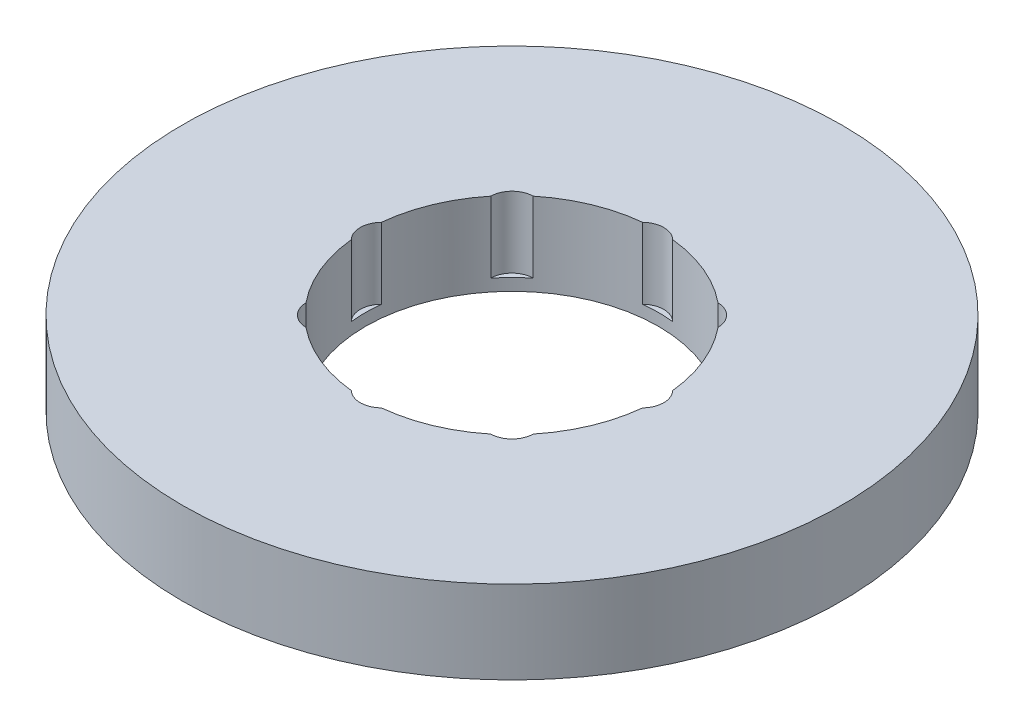
ISO-10303-21;
HEADER;
FILE_DESCRIPTION(('STEP AP214'),'2;1');
FILE_NAME('part.step','',(''),(''),'','','');
FILE_SCHEMA(('AUTOMOTIVE_DESIGN { 1 0 10303 214 1 1 1 1 }'));
ENDSEC;
DATA;
#1=APPLICATION_CONTEXT('core data for automotive mechanical design processes');
#2=APPLICATION_PROTOCOL_DEFINITION('international standard','automotive_design',2000,#1);
#3=PRODUCT_CONTEXT('',#1,'mechanical');
#4=PRODUCT('Part','Part','',(#3));
#5=PRODUCT_RELATED_PRODUCT_CATEGORY('part','',(#4));
#6=PRODUCT_DEFINITION_FORMATION('','',#4);
#7=PRODUCT_DEFINITION_CONTEXT('part definition',#1,'design');
#8=PRODUCT_DEFINITION('design','',#6,#7);
#9=PRODUCT_DEFINITION_SHAPE('','',#8);
#10=(LENGTH_UNIT() NAMED_UNIT(*) SI_UNIT(.MILLI.,.METRE.));
#11=(NAMED_UNIT(*) PLANE_ANGLE_UNIT() SI_UNIT($,.RADIAN.));
#12=(NAMED_UNIT(*) SI_UNIT($,.STERADIAN.) SOLID_ANGLE_UNIT());
#13=UNCERTAINTY_MEASURE_WITH_UNIT(LENGTH_MEASURE(1.E-05),#10,'distance_accuracy_value','');
#14=(GEOMETRIC_REPRESENTATION_CONTEXT(3) GLOBAL_UNCERTAINTY_ASSIGNED_CONTEXT((#13)) GLOBAL_UNIT_ASSIGNED_CONTEXT((#10,
#11,#12)) REPRESENTATION_CONTEXT('',''));
#15=CARTESIAN_POINT('',(0.,0.,0.));
#16=DIRECTION('',(0.,0.,1.));
#17=DIRECTION('',(1.,0.,0.));
#18=AXIS2_PLACEMENT_3D('',#15,#16,#17);
#19=CARTESIAN_POINT('',(0.,17.,0.));
#20=DIRECTION('',(0.,-1.,0.));
#21=DIRECTION('',(0.,0.,-1.));
#22=AXIS2_PLACEMENT_3D('',#19,#20,#21);
#23=CYLINDRICAL_SURFACE('',#22,67.5);
#24=CARTESIAN_POINT('',(0.,17.,0.));
#25=DIRECTION('',(0.,1.,0.));
#26=DIRECTION('',(0.,0.,1.));
#27=AXIS2_PLACEMENT_3D('',#24,#25,#26);
#28=CIRCLE('',#27,67.5);
#29=CARTESIAN_POINT('',(0.,17.,67.5));
#30=VERTEX_POINT('',#29);
#31=EDGE_CURVE('E183',#30,#30,#28,.T.);
#32=ORIENTED_EDGE('',*,*,#31,.F.);
#33=EDGE_LOOP('',(#32));
#34=FACE_BOUND('',#33,.T.);
#35=CARTESIAN_POINT('',(0.,0.,0.));
#36=DIRECTION('',(0.,1.,0.));
#37=DIRECTION('',(0.,0.,1.));
#38=AXIS2_PLACEMENT_3D('',#35,#36,#37);
#39=CIRCLE('',#38,67.5);
#40=CARTESIAN_POINT('',(0.,0.,67.5));
#41=VERTEX_POINT('',#40);
#42=EDGE_CURVE('E182',#41,#41,#39,.T.);
#43=ORIENTED_EDGE('',*,*,#42,.T.);
#44=EDGE_LOOP('',(#43));
#45=FACE_BOUND('',#44,.T.);
#46=ADVANCED_FACE('F39',(#34,#45),#23,.T.);
#47=CARTESIAN_POINT('',(0.,17.,0.));
#48=DIRECTION('',(0.,1.,0.));
#49=DIRECTION('',(0.,0.,1.));
#50=AXIS2_PLACEMENT_3D('',#47,#48,#49);
#51=PLANE('',#50);
#52=CARTESIAN_POINT('',(0.,17.,26.6588130686792));
#53=DIRECTION('',(0.,1.,0.));
#54=DIRECTION('',(1.,0.,0.));
#55=AXIS2_PLACEMENT_3D('',#52,#53,#54);
#56=CIRCLE('',#55,4.42688473431246);
#57=CARTESIAN_POINT('',(-3.07664994384005,17.,29.8418200705498));
#58=VERTEX_POINT('',#57);
#59=CARTESIAN_POINT('',(3.07664994384026,17.,29.8418200705498));
#60=VERTEX_POINT('',#59);
#61=EDGE_CURVE('E256',#58,#60,#56,.T.);
#62=ORIENTED_EDGE('',*,*,#61,.F.);
#63=CARTESIAN_POINT('',(0.,17.,0.));
#64=DIRECTION('',(0.,1.,0.));
#65=DIRECTION('',(0.,0.,1.));
#66=AXIS2_PLACEMENT_3D('',#63,#64,#65);
#67=CIRCLE('',#66,30.);
#68=CARTESIAN_POINT('',(-18.9258332962079,17.,23.2768733734612));
#69=VERTEX_POINT('',#68);
#70=EDGE_CURVE('E175',#69,#58,#67,.T.);
#71=ORIENTED_EDGE('',*,*,#70,.F.);
#72=CARTESIAN_POINT('',(-18.8506274992476,17.,18.8506274992477));
#73=DIRECTION('',(0.,1.,0.));
#74=DIRECTION('',(0.707106781186549,0.,0.707106781186546));
#75=AXIS2_PLACEMENT_3D('',#72,#73,#74);
#76=CIRCLE('',#75,4.42688473431246);
#77=CARTESIAN_POINT('',(-23.2768733734611,17.,18.925833296208));
#78=VERTEX_POINT('',#77);
#79=EDGE_CURVE('E152',#78,#69,#76,.T.);
#80=ORIENTED_EDGE('',*,*,#79,.F.);
#81=CARTESIAN_POINT('',(-29.8418200705498,17.,3.07664994384015));
#82=VERTEX_POINT('',#81);
#83=EDGE_CURVE('E168',#82,#78,#67,.T.);
#84=ORIENTED_EDGE('',*,*,#83,.F.);
#85=CARTESIAN_POINT('',(-26.6588130686792,17.,0.));
#86=DIRECTION('',(0.,1.,0.));
#87=DIRECTION('',(0.,0.,1.));
#88=AXIS2_PLACEMENT_3D('',#85,#86,#87);
#89=CIRCLE('',#88,4.42688473431246);
#90=CARTESIAN_POINT('',(-29.8418200705498,17.,-3.07664994384015));
#91=VERTEX_POINT('',#90);
#92=EDGE_CURVE('E205',#91,#82,#89,.T.);
#93=ORIENTED_EDGE('',*,*,#92,.F.);
#94=CARTESIAN_POINT('',(-23.2768733734614,17.,-18.9258332962077));
#95=VERTEX_POINT('',#94);
#96=EDGE_CURVE('E181',#95,#91,#67,.T.);
#97=ORIENTED_EDGE('',*,*,#96,.F.);
#98=CARTESIAN_POINT('',(-18.8506274992479,17.,-18.8506274992474));
#99=DIRECTION('',(0.,1.,0.));
#100=DIRECTION('',(-0.707106781186539,0.,0.707106781186556));
#101=AXIS2_PLACEMENT_3D('',#98,#99,#100);
#102=CIRCLE('',#101,4.42688473431246);
#103=CARTESIAN_POINT('',(-18.9258332962083,17.,-23.2768733734609));
#104=VERTEX_POINT('',#103);
#105=EDGE_CURVE('E453',#104,#95,#102,.T.);
#106=ORIENTED_EDGE('',*,*,#105,.F.);
#107=CARTESIAN_POINT('',(-3.07664994384047,17.,-29.8418200705498));
#108=VERTEX_POINT('',#107);
#109=EDGE_CURVE('E189',#108,#104,#67,.T.);
#110=ORIENTED_EDGE('',*,*,#109,.F.);
#111=CARTESIAN_POINT('',(-2.79236245035003E-13,17.,-26.6588130686792));
#112=DIRECTION('',(0.,1.,0.));
#113=DIRECTION('',(-1.,0.,0.));
#114=AXIS2_PLACEMENT_3D('',#111,#112,#113);
#115=CIRCLE('',#114,4.42688473431246);
#116=CARTESIAN_POINT('',(3.07664994383984,17.,-29.8418200705498));
#117=VERTEX_POINT('',#116);
#118=EDGE_CURVE('E462',#117,#108,#115,.T.);
#119=ORIENTED_EDGE('',*,*,#118,.F.);
#120=CARTESIAN_POINT('',(18.9258332962078,17.,-23.2768733734613));
#121=VERTEX_POINT('',#120);
#122=EDGE_CURVE('E197',#121,#117,#67,.T.);
#123=ORIENTED_EDGE('',*,*,#122,.F.);
#124=CARTESIAN_POINT('',(18.8506274992475,17.,-18.8506274992478));
#125=DIRECTION('',(0.,1.,0.));
#126=DIRECTION('',(-0.707106781186554,0.,-0.707106781186541));
#127=AXIS2_PLACEMENT_3D('',#124,#125,#126);
#128=CIRCLE('',#127,4.42688473431246);
#129=CARTESIAN_POINT('',(23.276873373461,17.,-18.9258332962082));
#130=VERTEX_POINT('',#129);
#131=EDGE_CURVE('E470',#130,#121,#128,.T.);
#132=ORIENTED_EDGE('',*,*,#131,.F.);
#133=CARTESIAN_POINT('',(29.8418200705498,17.,-3.07664994384015));
#134=VERTEX_POINT('',#133);
#135=EDGE_CURVE('E489',#134,#130,#67,.T.);
#136=ORIENTED_EDGE('',*,*,#135,.F.);
#137=CARTESIAN_POINT('',(26.6588130686792,17.,0.));
#138=DIRECTION('',(0.,1.,0.));
#139=DIRECTION('',(0.,0.,-1.));
#140=AXIS2_PLACEMENT_3D('',#137,#138,#139);
#141=CIRCLE('',#140,4.42688473431246);
#142=CARTESIAN_POINT('',(29.8418200705498,17.,3.07664994384015));
#143=VERTEX_POINT('',#142);
#144=EDGE_CURVE('E476',#143,#134,#141,.T.);
#145=ORIENTED_EDGE('',*,*,#144,.F.);
#146=CARTESIAN_POINT('',(23.2768733734613,17.,18.9258332962079));
#147=VERTEX_POINT('',#146);
#148=EDGE_CURVE('E491',#147,#143,#67,.T.);
#149=ORIENTED_EDGE('',*,*,#148,.F.);
#150=CARTESIAN_POINT('',(18.8506274992477,17.,18.8506274992475));
#151=DIRECTION('',(0.,1.,0.));
#152=DIRECTION('',(0.707106781186544,0.,-0.707106781186551));
#153=AXIS2_PLACEMENT_3D('',#150,#151,#152);
#154=CIRCLE('',#153,4.42688473431246);
#155=CARTESIAN_POINT('',(18.9258332962081,17.,23.2768733734611));
#156=VERTEX_POINT('',#155);
#157=EDGE_CURVE('E475',#156,#147,#154,.T.);
#158=ORIENTED_EDGE('',*,*,#157,.F.);
#159=EDGE_CURVE('E190',#60,#156,#67,.T.);
#160=ORIENTED_EDGE('',*,*,#159,.F.);
#161=EDGE_LOOP('',(#62,#71,#80,#84,#93,#97,#106,#110,#119,#123,#132,#136,#145,#149,#158,#160));
#162=FACE_BOUND('',#161,.T.);
#163=ORIENTED_EDGE('',*,*,#31,.T.);
#164=EDGE_LOOP('',(#163));
#165=FACE_BOUND('',#164,.T.);
#166=ADVANCED_FACE('F170',(#162,#165),#51,.T.);
#167=CARTESIAN_POINT('',(0.,0.,0.));
#168=DIRECTION('',(0.,1.,0.));
#169=DIRECTION('',(0.,0.,1.));
#170=AXIS2_PLACEMENT_3D('',#167,#168,#169);
#171=PLANE('',#170);
#172=CARTESIAN_POINT('',(0.,0.,0.));
#173=DIRECTION('',(0.,1.,0.));
#174=DIRECTION('',(0.,0.,1.));
#175=AXIS2_PLACEMENT_3D('',#172,#173,#174);
#176=CIRCLE('',#175,30.);
#177=CARTESIAN_POINT('',(0.,0.,30.));
#178=VERTEX_POINT('',#177);
#179=EDGE_CURVE('E191',#178,#178,#176,.T.);
#180=ORIENTED_EDGE('',*,*,#179,.T.);
#181=EDGE_LOOP('',(#180));
#182=FACE_BOUND('',#181,.T.);
#183=ORIENTED_EDGE('',*,*,#42,.F.);
#184=EDGE_LOOP('',(#183));
#185=FACE_BOUND('',#184,.T.);
#186=ADVANCED_FACE('F277',(#182,#185),#171,.F.);
#187=CARTESIAN_POINT('',(0.,17.,0.));
#188=DIRECTION('',(0.,-1.,0.));
#189=DIRECTION('',(0.,0.,-1.));
#190=AXIS2_PLACEMENT_3D('',#187,#188,#189);
#191=CYLINDRICAL_SURFACE('',#190,30.);
#192=DIRECTION('',(0.,1.,0.));
#193=VECTOR('',#192,1.);
#194=CARTESIAN_POINT('',(-3.07664994384004,9.7318943138592,29.8418200705498));
#195=LINE('',#194,#193);
#196=CARTESIAN_POINT('',(-3.07664994384005,2.46378862771841,29.8418200705498));
#197=VERTEX_POINT('',#196);
#198=EDGE_CURVE('E11',#197,#58,#195,.T.);
#199=ORIENTED_EDGE('',*,*,#198,.F.);
#200=CARTESIAN_POINT('',(0.,2.46378862771841,0.));
#201=DIRECTION('',(0.,1.,0.));
#202=DIRECTION('',(0.,0.,1.));
#203=AXIS2_PLACEMENT_3D('',#200,#201,#202);
#204=CIRCLE('',#203,30.);
#205=CARTESIAN_POINT('',(3.07664994384026,2.46378862771841,29.8418200705498));
#206=VERTEX_POINT('',#205);
#207=EDGE_CURVE('E251',#197,#206,#204,.T.);
#208=ORIENTED_EDGE('',*,*,#207,.T.);
#209=DIRECTION('',(0.,1.,0.));
#210=VECTOR('',#209,1.);
#211=CARTESIAN_POINT('',(3.07664994384025,9.7318943138592,29.8418200705498));
#212=LINE('',#211,#210);
#213=EDGE_CURVE('E46',#60,#206,#212,.F.);
#214=ORIENTED_EDGE('',*,*,#213,.F.);
#215=ORIENTED_EDGE('',*,*,#159,.T.);
#216=DIRECTION('',(0.,1.,0.));
#217=VECTOR('',#216,1.);
#218=CARTESIAN_POINT('',(18.9258332962081,9.7318943138592,23.2768733734611));
#219=LINE('',#218,#217);
#220=CARTESIAN_POINT('',(18.9258332962081,2.46378862771841,23.2768733734611));
#221=VERTEX_POINT('',#220);
#222=EDGE_CURVE('E253',#221,#156,#219,.T.);
#223=ORIENTED_EDGE('',*,*,#222,.F.);
#224=CARTESIAN_POINT('',(0.,2.46378862771841,0.));
#225=DIRECTION('',(0.,1.,0.));
#226=DIRECTION('',(0.,0.,1.));
#227=AXIS2_PLACEMENT_3D('',#224,#225,#226);
#228=CIRCLE('',#227,30.);
#229=CARTESIAN_POINT('',(23.2768733734613,2.46378862771841,18.9258332962079));
#230=VERTEX_POINT('',#229);
#231=EDGE_CURVE('E246',#221,#230,#228,.T.);
#232=ORIENTED_EDGE('',*,*,#231,.T.);
#233=DIRECTION('',(0.,1.,0.));
#234=VECTOR('',#233,1.);
#235=CARTESIAN_POINT('',(23.2768733734613,9.7318943138592,18.9258332962079));
#236=LINE('',#235,#234);
#237=EDGE_CURVE('E248',#147,#230,#236,.F.);
#238=ORIENTED_EDGE('',*,*,#237,.F.);
#239=ORIENTED_EDGE('',*,*,#148,.T.);
#240=DIRECTION('',(0.,1.,0.));
#241=VECTOR('',#240,1.);
#242=CARTESIAN_POINT('',(29.8418200705498,9.7318943138592,3.07664994384015));
#243=LINE('',#242,#241);
#244=CARTESIAN_POINT('',(29.8418200705498,2.46378862771841,3.07664994384015));
#245=VERTEX_POINT('',#244);
#246=EDGE_CURVE('E243',#245,#143,#243,.T.);
#247=ORIENTED_EDGE('',*,*,#246,.F.);
#248=CARTESIAN_POINT('',(0.,2.46378862771841,0.));
#249=DIRECTION('',(0.,1.,0.));
#250=DIRECTION('',(0.,0.,1.));
#251=AXIS2_PLACEMENT_3D('',#248,#249,#250);
#252=CIRCLE('',#251,30.);
#253=CARTESIAN_POINT('',(29.8418200705498,2.46378862771841,-3.07664994384015));
#254=VERTEX_POINT('',#253);
#255=EDGE_CURVE('E236',#245,#254,#252,.T.);
#256=ORIENTED_EDGE('',*,*,#255,.T.);
#257=DIRECTION('',(0.,1.,0.));
#258=VECTOR('',#257,1.);
#259=CARTESIAN_POINT('',(29.8418200705498,9.7318943138592,-3.07664994384015));
#260=LINE('',#259,#258);
#261=EDGE_CURVE('E241',#134,#254,#260,.F.);
#262=ORIENTED_EDGE('',*,*,#261,.F.);
#263=ORIENTED_EDGE('',*,*,#135,.T.);
#264=DIRECTION('',(0.,1.,0.));
#265=VECTOR('',#264,1.);
#266=CARTESIAN_POINT('',(23.276873373461,9.7318943138592,-18.9258332962082));
#267=LINE('',#266,#265);
#268=CARTESIAN_POINT('',(23.276873373461,2.46378862771841,-18.9258332962082));
#269=VERTEX_POINT('',#268);
#270=EDGE_CURVE('E237',#269,#130,#267,.T.);
#271=ORIENTED_EDGE('',*,*,#270,.F.);
#272=CARTESIAN_POINT('',(0.,2.46378862771841,0.));
#273=DIRECTION('',(0.,1.,0.));
#274=DIRECTION('',(0.,0.,1.));
#275=AXIS2_PLACEMENT_3D('',#272,#273,#274);
#276=CIRCLE('',#275,30.);
#277=CARTESIAN_POINT('',(18.9258332962078,2.46378862771841,-23.2768733734613));
#278=VERTEX_POINT('',#277);
#279=EDGE_CURVE('E229',#269,#278,#276,.T.);
#280=ORIENTED_EDGE('',*,*,#279,.T.);
#281=DIRECTION('',(0.,1.,0.));
#282=VECTOR('',#281,1.);
#283=CARTESIAN_POINT('',(18.9258332962078,9.7318943138592,-23.2768733734613));
#284=LINE('',#283,#282);
#285=EDGE_CURVE('E232',#121,#278,#284,.F.);
#286=ORIENTED_EDGE('',*,*,#285,.F.);
#287=ORIENTED_EDGE('',*,*,#122,.T.);
#288=DIRECTION('',(0.,1.,0.));
#289=VECTOR('',#288,1.);
#290=CARTESIAN_POINT('',(3.07664994383983,9.7318943138592,-29.8418200705498));
#291=LINE('',#290,#289);
#292=CARTESIAN_POINT('',(3.07664994383984,2.46378862771841,-29.8418200705498));
#293=VERTEX_POINT('',#292);
#294=EDGE_CURVE('E227',#293,#117,#291,.T.);
#295=ORIENTED_EDGE('',*,*,#294,.F.);
#296=CARTESIAN_POINT('',(0.,2.46378862771841,0.));
#297=DIRECTION('',(0.,1.,0.));
#298=DIRECTION('',(0.,0.,1.));
#299=AXIS2_PLACEMENT_3D('',#296,#297,#298);
#300=CIRCLE('',#299,30.);
#301=CARTESIAN_POINT('',(-3.07664994384047,2.46378862771841,-29.8418200705498));
#302=VERTEX_POINT('',#301);
#303=EDGE_CURVE('E225',#293,#302,#300,.T.);
#304=ORIENTED_EDGE('',*,*,#303,.T.);
#305=DIRECTION('',(0.,1.,0.));
#306=VECTOR('',#305,1.);
#307=CARTESIAN_POINT('',(-3.07664994384046,9.7318943138592,-29.8418200705498));
#308=LINE('',#307,#306);
#309=EDGE_CURVE('E223',#108,#302,#308,.F.);
#310=ORIENTED_EDGE('',*,*,#309,.F.);
#311=ORIENTED_EDGE('',*,*,#109,.T.);
#312=DIRECTION('',(0.,1.,0.));
#313=VECTOR('',#312,1.);
#314=CARTESIAN_POINT('',(-18.9258332962083,9.7318943138592,-23.2768733734609));
#315=LINE('',#314,#313);
#316=CARTESIAN_POINT('',(-18.9258332962083,2.46378862771841,-23.2768733734609));
#317=VERTEX_POINT('',#316);
#318=EDGE_CURVE('E219',#317,#104,#315,.T.);
#319=ORIENTED_EDGE('',*,*,#318,.F.);
#320=CARTESIAN_POINT('',(0.,2.46378862771841,0.));
#321=DIRECTION('',(0.,1.,0.));
#322=DIRECTION('',(0.,0.,1.));
#323=AXIS2_PLACEMENT_3D('',#320,#321,#322);
#324=CIRCLE('',#323,30.);
#325=CARTESIAN_POINT('',(-23.2768733734614,2.46378862771841,-18.9258332962077));
#326=VERTEX_POINT('',#325);
#327=EDGE_CURVE('E159',#317,#326,#324,.T.);
#328=ORIENTED_EDGE('',*,*,#327,.T.);
#329=DIRECTION('',(0.,1.,0.));
#330=VECTOR('',#329,1.);
#331=CARTESIAN_POINT('',(-23.2768733734614,9.7318943138592,-18.9258332962077));
#332=LINE('',#331,#330);
#333=EDGE_CURVE('E220',#95,#326,#332,.F.);
#334=ORIENTED_EDGE('',*,*,#333,.F.);
#335=ORIENTED_EDGE('',*,*,#96,.T.);
#336=DIRECTION('',(0.,1.,0.));
#337=VECTOR('',#336,1.);
#338=CARTESIAN_POINT('',(-29.8418200705498,9.7318943138592,-3.07664994384015));
#339=LINE('',#338,#337);
#340=CARTESIAN_POINT('',(-29.8418200705498,2.46378862771841,-3.07664994384015));
#341=VERTEX_POINT('',#340);
#342=EDGE_CURVE('E209',#341,#91,#339,.T.);
#343=ORIENTED_EDGE('',*,*,#342,.F.);
#344=CARTESIAN_POINT('',(0.,2.46378862771841,0.));
#345=DIRECTION('',(0.,1.,0.));
#346=DIRECTION('',(0.,0.,1.));
#347=AXIS2_PLACEMENT_3D('',#344,#345,#346);
#348=CIRCLE('',#347,30.);
#349=CARTESIAN_POINT('',(-29.8418200705498,2.46378862771841,3.07664994384015));
#350=VERTEX_POINT('',#349);
#351=EDGE_CURVE('E206',#341,#350,#348,.T.);
#352=ORIENTED_EDGE('',*,*,#351,.T.);
#353=DIRECTION('',(0.,1.,0.));
#354=VECTOR('',#353,1.);
#355=CARTESIAN_POINT('',(-29.8418200705498,9.7318943138592,3.07664994384015));
#356=LINE('',#355,#354);
#357=EDGE_CURVE('E179',#82,#350,#356,.F.);
#358=ORIENTED_EDGE('',*,*,#357,.F.);
#359=ORIENTED_EDGE('',*,*,#83,.T.);
#360=DIRECTION('',(0.,1.,0.));
#361=VECTOR('',#360,1.);
#362=CARTESIAN_POINT('',(-23.2768733734611,9.7318943138592,18.925833296208));
#363=LINE('',#362,#361);
#364=CARTESIAN_POINT('',(-23.2768733734611,2.46378862771841,18.925833296208));
#365=VERTEX_POINT('',#364);
#366=EDGE_CURVE('E147',#365,#78,#363,.T.);
#367=ORIENTED_EDGE('',*,*,#366,.F.);
#368=CARTESIAN_POINT('',(0.,2.46378862771841,0.));
#369=DIRECTION('',(0.,1.,0.));
#370=DIRECTION('',(0.,0.,1.));
#371=AXIS2_PLACEMENT_3D('',#368,#369,#370);
#372=CIRCLE('',#371,30.);
#373=CARTESIAN_POINT('',(-18.9258332962079,2.46378862771841,23.2768733734612));
#374=VERTEX_POINT('',#373);
#375=EDGE_CURVE('E215',#365,#374,#372,.T.);
#376=ORIENTED_EDGE('',*,*,#375,.T.);
#377=DIRECTION('',(0.,1.,0.));
#378=VECTOR('',#377,1.);
#379=CARTESIAN_POINT('',(-18.9258332962079,9.7318943138592,23.2768733734612));
#380=LINE('',#379,#378);
#381=EDGE_CURVE('E161',#69,#374,#380,.F.);
#382=ORIENTED_EDGE('',*,*,#381,.F.);
#383=ORIENTED_EDGE('',*,*,#70,.T.);
#384=EDGE_LOOP('',(#199,#208,#214,#215,#223,#232,#238,#239,#247,#256,#262,#263,#271,#280,#286,
#287,#295,#304,#310,#311,#319,#328,#334,#335,#343,#352,#358,#359,#367,#376,#382,#383));
#385=FACE_BOUND('',#384,.T.);
#386=ORIENTED_EDGE('',*,*,#179,.F.);
#387=EDGE_LOOP('',(#386));
#388=FACE_BOUND('',#387,.T.);
#389=ADVANCED_FACE('F176',(#385,#388),#191,.F.);
#390=CARTESIAN_POINT('',(-26.6588130686792,2.46378862771841,0.));
#391=DIRECTION('',(0.,1.,0.));
#392=DIRECTION('',(0.,0.,1.));
#393=AXIS2_PLACEMENT_3D('',#390,#391,#392);
#394=CYLINDRICAL_SURFACE('',#393,4.42688473431246);
#395=ORIENTED_EDGE('',*,*,#342,.T.);
#396=ORIENTED_EDGE('',*,*,#92,.T.);
#397=ORIENTED_EDGE('',*,*,#357,.T.);
#398=CARTESIAN_POINT('',(-26.6588130686792,2.46378862771841,0.));
#399=DIRECTION('',(0.,1.,0.));
#400=DIRECTION('',(0.,0.,1.));
#401=AXIS2_PLACEMENT_3D('',#398,#399,#400);
#402=CIRCLE('',#401,4.42688473431246);
#403=EDGE_CURVE('E200',#341,#350,#402,.T.);
#404=ORIENTED_EDGE('',*,*,#403,.F.);
#405=EDGE_LOOP('',(#395,#396,#397,#404));
#406=FACE_BOUND('',#405,.T.);
#407=ADVANCED_FACE('F286',(#406),#394,.F.);
#408=CARTESIAN_POINT('',(-26.6588130686792,2.46378862771841,0.));
#409=DIRECTION('',(0.,1.,0.));
#410=DIRECTION('',(0.,0.,1.));
#411=AXIS2_PLACEMENT_3D('',#408,#409,#410);
#412=PLANE('',#411);
#413=ORIENTED_EDGE('',*,*,#403,.T.);
#414=ORIENTED_EDGE('',*,*,#351,.F.);
#415=EDGE_LOOP('',(#413,#414));
#416=FACE_BOUND('',#415,.T.);
#417=ADVANCED_FACE('F289',(#416),#412,.T.);
#418=CARTESIAN_POINT('',(-18.8506274992476,2.46378862771841,18.8506274992477));
#419=DIRECTION('',(0.,1.,0.));
#420=DIRECTION('',(0.,0.,1.));
#421=AXIS2_PLACEMENT_3D('',#418,#419,#420);
#422=CYLINDRICAL_SURFACE('',#421,4.42688473431246);
#423=ORIENTED_EDGE('',*,*,#366,.T.);
#424=ORIENTED_EDGE('',*,*,#79,.T.);
#425=ORIENTED_EDGE('',*,*,#381,.T.);
#426=CARTESIAN_POINT('',(-18.8506274992476,2.46378862771841,18.8506274992477));
#427=DIRECTION('',(0.,1.,0.));
#428=DIRECTION('',(0.707106781186549,0.,0.707106781186546));
#429=AXIS2_PLACEMENT_3D('',#426,#427,#428);
#430=CIRCLE('',#429,4.42688473431246);
#431=EDGE_CURVE('E156',#365,#374,#430,.T.);
#432=ORIENTED_EDGE('',*,*,#431,.F.);
#433=EDGE_LOOP('',(#423,#424,#425,#432));
#434=FACE_BOUND('',#433,.T.);
#435=ADVANCED_FACE('F155',(#434),#422,.F.);
#436=CARTESIAN_POINT('',(-18.8506274992476,2.46378862771841,18.8506274992477));
#437=DIRECTION('',(0.,1.,0.));
#438=DIRECTION('',(0.707106781186549,0.,0.707106781186546));
#439=AXIS2_PLACEMENT_3D('',#436,#437,#438);
#440=PLANE('',#439);
#441=ORIENTED_EDGE('',*,*,#431,.T.);
#442=ORIENTED_EDGE('',*,*,#375,.F.);
#443=EDGE_LOOP('',(#441,#442));
#444=FACE_BOUND('',#443,.T.);
#445=ADVANCED_FACE('F300',(#444),#440,.T.);
#446=CARTESIAN_POINT('',(-18.8506274992479,2.46378862771841,-18.8506274992474));
#447=DIRECTION('',(0.,1.,0.));
#448=DIRECTION('',(0.,0.,1.));
#449=AXIS2_PLACEMENT_3D('',#446,#447,#448);
#450=CYLINDRICAL_SURFACE('',#449,4.42688473431246);
#451=ORIENTED_EDGE('',*,*,#318,.T.);
#452=ORIENTED_EDGE('',*,*,#105,.T.);
#453=ORIENTED_EDGE('',*,*,#333,.T.);
#454=CARTESIAN_POINT('',(-18.8506274992479,2.46378862771841,-18.8506274992474));
#455=DIRECTION('',(0.,1.,0.));
#456=DIRECTION('',(-0.707106781186539,0.,0.707106781186556));
#457=AXIS2_PLACEMENT_3D('',#454,#455,#456);
#458=CIRCLE('',#457,4.42688473431246);
#459=EDGE_CURVE('E454',#317,#326,#458,.T.);
#460=ORIENTED_EDGE('',*,*,#459,.F.);
#461=EDGE_LOOP('',(#451,#452,#453,#460));
#462=FACE_BOUND('',#461,.T.);
#463=ADVANCED_FACE('F299',(#462),#450,.F.);
#464=CARTESIAN_POINT('',(-18.8506274992479,2.46378862771841,-18.8506274992474));
#465=DIRECTION('',(0.,1.,0.));
#466=DIRECTION('',(-0.707106781186539,0.,0.707106781186556));
#467=AXIS2_PLACEMENT_3D('',#464,#465,#466);
#468=PLANE('',#467);
#469=ORIENTED_EDGE('',*,*,#459,.T.);
#470=ORIENTED_EDGE('',*,*,#327,.F.);
#471=EDGE_LOOP('',(#469,#470));
#472=FACE_BOUND('',#471,.T.);
#473=ADVANCED_FACE('F379',(#472),#468,.T.);
#474=CARTESIAN_POINT('',(-2.79236245035003E-13,2.46378862771841,-26.6588130686792));
#475=DIRECTION('',(0.,1.,0.));
#476=DIRECTION('',(0.,0.,1.));
#477=AXIS2_PLACEMENT_3D('',#474,#475,#476);
#478=CYLINDRICAL_SURFACE('',#477,4.42688473431246);
#479=ORIENTED_EDGE('',*,*,#294,.T.);
#480=ORIENTED_EDGE('',*,*,#118,.T.);
#481=ORIENTED_EDGE('',*,*,#309,.T.);
#482=CARTESIAN_POINT('',(-2.79236245035003E-13,2.46378862771841,-26.6588130686792));
#483=DIRECTION('',(0.,1.,0.));
#484=DIRECTION('',(-1.,0.,0.));
#485=AXIS2_PLACEMENT_3D('',#482,#483,#484);
#486=CIRCLE('',#485,4.42688473431246);
#487=EDGE_CURVE('E465',#293,#302,#486,.T.);
#488=ORIENTED_EDGE('',*,*,#487,.F.);
#489=EDGE_LOOP('',(#479,#480,#481,#488));
#490=FACE_BOUND('',#489,.T.);
#491=ADVANCED_FACE('F371',(#490),#478,.F.);
#492=CARTESIAN_POINT('',(-2.79236245035003E-13,2.46378862771841,-26.6588130686792));
#493=DIRECTION('',(0.,1.,0.));
#494=DIRECTION('',(-1.,0.,0.));
#495=AXIS2_PLACEMENT_3D('',#492,#493,#494);
#496=PLANE('',#495);
#497=ORIENTED_EDGE('',*,*,#487,.T.);
#498=ORIENTED_EDGE('',*,*,#303,.F.);
#499=EDGE_LOOP('',(#497,#498));
#500=FACE_BOUND('',#499,.T.);
#501=ADVANCED_FACE('F308',(#500),#496,.T.);
#502=CARTESIAN_POINT('',(18.8506274992475,2.46378862771841,-18.8506274992478));
#503=DIRECTION('',(0.,1.,0.));
#504=DIRECTION('',(0.,0.,1.));
#505=AXIS2_PLACEMENT_3D('',#502,#503,#504);
#506=CYLINDRICAL_SURFACE('',#505,4.42688473431246);
#507=ORIENTED_EDGE('',*,*,#270,.T.);
#508=ORIENTED_EDGE('',*,*,#131,.T.);
#509=ORIENTED_EDGE('',*,*,#285,.T.);
#510=CARTESIAN_POINT('',(18.8506274992475,2.46378862771841,-18.8506274992478));
#511=DIRECTION('',(0.,1.,0.));
#512=DIRECTION('',(-0.707106781186554,0.,-0.707106781186541));
#513=AXIS2_PLACEMENT_3D('',#510,#511,#512);
#514=CIRCLE('',#513,4.42688473431246);
#515=EDGE_CURVE('E477',#269,#278,#514,.T.);
#516=ORIENTED_EDGE('',*,*,#515,.F.);
#517=EDGE_LOOP('',(#507,#508,#509,#516));
#518=FACE_BOUND('',#517,.T.);
#519=ADVANCED_FACE('F305',(#518),#506,.F.);
#520=CARTESIAN_POINT('',(18.8506274992475,2.46378862771841,-18.8506274992478));
#521=DIRECTION('',(0.,1.,0.));
#522=DIRECTION('',(-0.707106781186554,0.,-0.707106781186541));
#523=AXIS2_PLACEMENT_3D('',#520,#521,#522);
#524=PLANE('',#523);
#525=ORIENTED_EDGE('',*,*,#515,.T.);
#526=ORIENTED_EDGE('',*,*,#279,.F.);
#527=EDGE_LOOP('',(#525,#526));
#528=FACE_BOUND('',#527,.T.);
#529=ADVANCED_FACE('F304',(#528),#524,.T.);
#530=CARTESIAN_POINT('',(26.6588130686792,2.46378862771841,0.));
#531=DIRECTION('',(0.,1.,0.));
#532=DIRECTION('',(0.,0.,1.));
#533=AXIS2_PLACEMENT_3D('',#530,#531,#532);
#534=CYLINDRICAL_SURFACE('',#533,4.42688473431246);
#535=ORIENTED_EDGE('',*,*,#246,.T.);
#536=ORIENTED_EDGE('',*,*,#144,.T.);
#537=ORIENTED_EDGE('',*,*,#261,.T.);
#538=CARTESIAN_POINT('',(26.6588130686792,2.46378862771841,0.));
#539=DIRECTION('',(0.,1.,0.));
#540=DIRECTION('',(0.,0.,-1.));
#541=AXIS2_PLACEMENT_3D('',#538,#539,#540);
#542=CIRCLE('',#541,4.42688473431246);
#543=EDGE_CURVE('E478',#245,#254,#542,.T.);
#544=ORIENTED_EDGE('',*,*,#543,.F.);
#545=EDGE_LOOP('',(#535,#536,#537,#544));
#546=FACE_BOUND('',#545,.T.);
#547=ADVANCED_FACE('F309',(#546),#534,.F.);
#548=CARTESIAN_POINT('',(26.6588130686792,2.46378862771841,0.));
#549=DIRECTION('',(0.,1.,0.));
#550=DIRECTION('',(0.,0.,-1.));
#551=AXIS2_PLACEMENT_3D('',#548,#549,#550);
#552=PLANE('',#551);
#553=ORIENTED_EDGE('',*,*,#543,.T.);
#554=ORIENTED_EDGE('',*,*,#255,.F.);
#555=EDGE_LOOP('',(#553,#554));
#556=FACE_BOUND('',#555,.T.);
#557=ADVANCED_FACE('F314',(#556),#552,.T.);
#558=CARTESIAN_POINT('',(18.8506274992477,2.46378862771841,18.8506274992475));
#559=DIRECTION('',(0.,1.,0.));
#560=DIRECTION('',(0.,0.,1.));
#561=AXIS2_PLACEMENT_3D('',#558,#559,#560);
#562=CYLINDRICAL_SURFACE('',#561,4.42688473431246);
#563=ORIENTED_EDGE('',*,*,#222,.T.);
#564=ORIENTED_EDGE('',*,*,#157,.T.);
#565=ORIENTED_EDGE('',*,*,#237,.T.);
#566=CARTESIAN_POINT('',(18.8506274992477,2.46378862771841,18.8506274992475));
#567=DIRECTION('',(0.,1.,0.));
#568=DIRECTION('',(0.707106781186544,0.,-0.707106781186551));
#569=AXIS2_PLACEMENT_3D('',#566,#567,#568);
#570=CIRCLE('',#569,4.42688473431246);
#571=EDGE_CURVE('E56',#221,#230,#570,.T.);
#572=ORIENTED_EDGE('',*,*,#571,.F.);
#573=EDGE_LOOP('',(#563,#564,#565,#572));
#574=FACE_BOUND('',#573,.T.);
#575=ADVANCED_FACE('F318',(#574),#562,.F.);
#576=CARTESIAN_POINT('',(18.8506274992477,2.46378862771841,18.8506274992475));
#577=DIRECTION('',(0.,1.,0.));
#578=DIRECTION('',(0.707106781186544,0.,-0.707106781186551));
#579=AXIS2_PLACEMENT_3D('',#576,#577,#578);
#580=PLANE('',#579);
#581=ORIENTED_EDGE('',*,*,#571,.T.);
#582=ORIENTED_EDGE('',*,*,#231,.F.);
#583=EDGE_LOOP('',(#581,#582));
#584=FACE_BOUND('',#583,.T.);
#585=ADVANCED_FACE('F270',(#584),#580,.T.);
#586=CARTESIAN_POINT('',(0.,2.46378862771841,26.6588130686792));
#587=DIRECTION('',(0.,1.,0.));
#588=DIRECTION('',(0.,0.,1.));
#589=AXIS2_PLACEMENT_3D('',#586,#587,#588);
#590=CYLINDRICAL_SURFACE('',#589,4.42688473431246);
#591=ORIENTED_EDGE('',*,*,#198,.T.);
#592=ORIENTED_EDGE('',*,*,#61,.T.);
#593=ORIENTED_EDGE('',*,*,#213,.T.);
#594=CARTESIAN_POINT('',(0.,2.46378862771841,26.6588130686792));
#595=DIRECTION('',(0.,1.,0.));
#596=DIRECTION('',(1.,0.,0.));
#597=AXIS2_PLACEMENT_3D('',#594,#595,#596);
#598=CIRCLE('',#597,4.42688473431246);
#599=EDGE_CURVE('E55',#197,#206,#598,.T.);
#600=ORIENTED_EDGE('',*,*,#599,.F.);
#601=EDGE_LOOP('',(#591,#592,#593,#600));
#602=FACE_BOUND('',#601,.T.);
#603=ADVANCED_FACE('F260',(#602),#590,.F.);
#604=CARTESIAN_POINT('',(0.,2.46378862771841,26.6588130686792));
#605=DIRECTION('',(0.,1.,0.));
#606=DIRECTION('',(1.,0.,0.));
#607=AXIS2_PLACEMENT_3D('',#604,#605,#606);
#608=PLANE('',#607);
#609=ORIENTED_EDGE('',*,*,#599,.T.);
#610=ORIENTED_EDGE('',*,*,#207,.F.);
#611=EDGE_LOOP('',(#609,#610));
#612=FACE_BOUND('',#611,.T.);
#613=ADVANCED_FACE('F261',(#612),#608,.T.);
#614=CLOSED_SHELL('',(#46,#166,#186,#389,#407,#417,#435,#445,#463,#473,#491,#501,#519,#529,#547,
#557,#575,#585,#603,#613));
#615=MANIFOLD_SOLID_BREP('B2',#614);
#616=ADVANCED_BREP_SHAPE_REPRESENTATION('',(#18,#615),#14);
#617=SHAPE_DEFINITION_REPRESENTATION(#9,#616);
ENDSEC;
END-ISO-10303-21;
